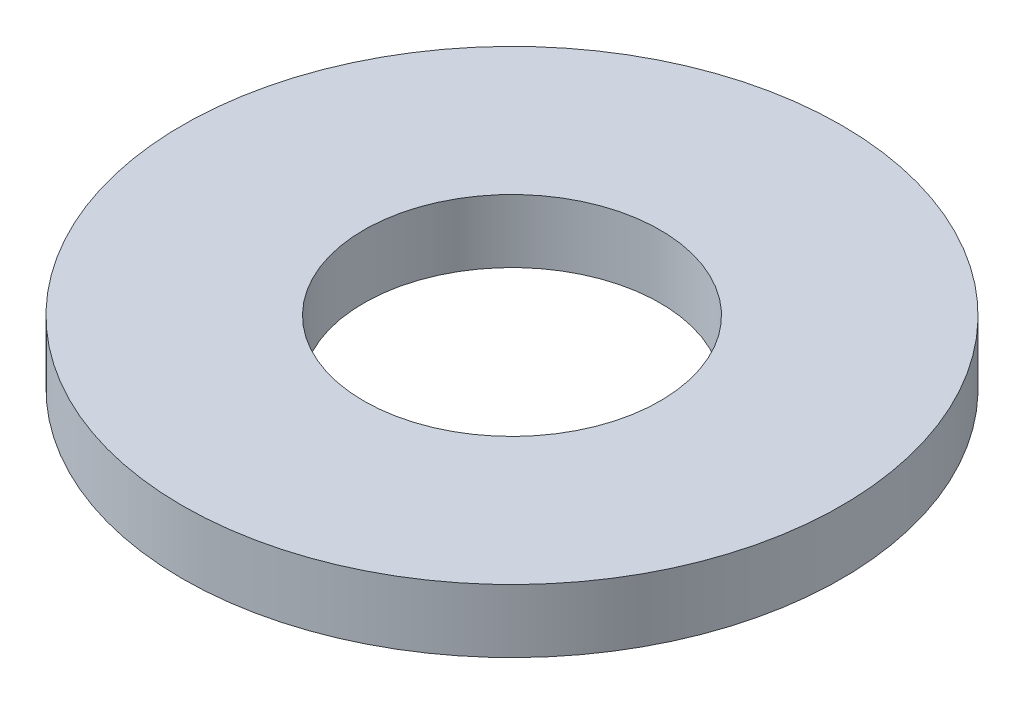
ISO-10303-21;
HEADER;
FILE_DESCRIPTION(('STEP AP214'),'2;1');
FILE_NAME('part.step','',(''),(''),'','','');
FILE_SCHEMA(('AUTOMOTIVE_DESIGN { 1 0 10303 214 1 1 1 1 }'));
ENDSEC;
DATA;
#1=APPLICATION_CONTEXT('core data for automotive mechanical design processes');
#2=APPLICATION_PROTOCOL_DEFINITION('international standard','automotive_design',2000,#1);
#3=PRODUCT_CONTEXT('',#1,'mechanical');
#4=PRODUCT('Part','Part','',(#3));
#5=PRODUCT_RELATED_PRODUCT_CATEGORY('part','',(#4));
#6=PRODUCT_DEFINITION_FORMATION('','',#4);
#7=PRODUCT_DEFINITION_CONTEXT('part definition',#1,'design');
#8=PRODUCT_DEFINITION('design','',#6,#7);
#9=PRODUCT_DEFINITION_SHAPE('','',#8);
#10=(LENGTH_UNIT() NAMED_UNIT(*) SI_UNIT(.MILLI.,.METRE.));
#11=(NAMED_UNIT(*) PLANE_ANGLE_UNIT() SI_UNIT($,.RADIAN.));
#12=(NAMED_UNIT(*) SI_UNIT($,.STERADIAN.) SOLID_ANGLE_UNIT());
#13=UNCERTAINTY_MEASURE_WITH_UNIT(LENGTH_MEASURE(1.E-05),#10,'distance_accuracy_value','');
#14=(GEOMETRIC_REPRESENTATION_CONTEXT(3) GLOBAL_UNCERTAINTY_ASSIGNED_CONTEXT((#13)) GLOBAL_UNIT_ASSIGNED_CONTEXT((#10,
#11,#12)) REPRESENTATION_CONTEXT('',''));
#15=CARTESIAN_POINT('',(0.,0.,0.));
#16=DIRECTION('',(0.,0.,1.));
#17=DIRECTION('',(1.,0.,0.));
#18=AXIS2_PLACEMENT_3D('',#15,#16,#17);
#19=CARTESIAN_POINT('',(0.,1.524,0.));
#20=DIRECTION('',(0.,-1.,0.));
#21=DIRECTION('',(0.,0.,-1.));
#22=AXIS2_PLACEMENT_3D('',#19,#20,#21);
#23=CYLINDRICAL_SURFACE('',#22,7.9375);
#24=CARTESIAN_POINT('',(0.,1.524,0.));
#25=DIRECTION('',(0.,1.,0.));
#26=DIRECTION('',(0.,0.,1.));
#27=AXIS2_PLACEMENT_3D('',#24,#25,#26);
#28=CIRCLE('',#27,7.9375);
#29=CARTESIAN_POINT('',(0.,1.524,7.9375));
#30=VERTEX_POINT('',#29);
#31=EDGE_CURVE('E10',#30,#30,#28,.T.);
#32=ORIENTED_EDGE('',*,*,#31,.F.);
#33=EDGE_LOOP('',(#32));
#34=FACE_BOUND('',#33,.T.);
#35=CARTESIAN_POINT('',(0.,0.,0.));
#36=DIRECTION('',(0.,1.,0.));
#37=DIRECTION('',(0.,0.,1.));
#38=AXIS2_PLACEMENT_3D('',#35,#36,#37);
#39=CIRCLE('',#38,7.9375);
#40=CARTESIAN_POINT('',(0.,0.,7.9375));
#41=VERTEX_POINT('',#40);
#42=EDGE_CURVE('E33',#41,#41,#39,.T.);
#43=ORIENTED_EDGE('',*,*,#42,.T.);
#44=EDGE_LOOP('',(#43));
#45=FACE_BOUND('',#44,.T.);
#46=ADVANCED_FACE('F30',(#34,#45),#23,.T.);
#47=CARTESIAN_POINT('',(0.,1.524,0.));
#48=DIRECTION('',(0.,1.,0.));
#49=DIRECTION('',(0.,0.,1.));
#50=AXIS2_PLACEMENT_3D('',#47,#48,#49);
#51=PLANE('',#50);
#52=CARTESIAN_POINT('',(0.,1.524,0.));
#53=DIRECTION('',(0.,1.,0.));
#54=DIRECTION('',(0.,0.,1.));
#55=AXIS2_PLACEMENT_3D('',#52,#53,#54);
#56=CIRCLE('',#55,3.5687);
#57=CARTESIAN_POINT('',(0.,1.524,3.5687));
#58=VERTEX_POINT('',#57);
#59=EDGE_CURVE('E42',#58,#58,#56,.T.);
#60=ORIENTED_EDGE('',*,*,#59,.F.);
#61=EDGE_LOOP('',(#60));
#62=FACE_BOUND('',#61,.T.);
#63=ORIENTED_EDGE('',*,*,#31,.T.);
#64=EDGE_LOOP('',(#63));
#65=FACE_BOUND('',#64,.T.);
#66=ADVANCED_FACE('F57',(#62,#65),#51,.T.);
#67=CARTESIAN_POINT('',(0.,0.,0.));
#68=DIRECTION('',(0.,1.,0.));
#69=DIRECTION('',(0.,0.,1.));
#70=AXIS2_PLACEMENT_3D('',#67,#68,#69);
#71=PLANE('',#70);
#72=CARTESIAN_POINT('',(0.,0.,0.));
#73=DIRECTION('',(0.,1.,0.));
#74=DIRECTION('',(0.,0.,1.));
#75=AXIS2_PLACEMENT_3D('',#72,#73,#74);
#76=CIRCLE('',#75,3.5687);
#77=CARTESIAN_POINT('',(0.,0.,3.5687));
#78=VERTEX_POINT('',#77);
#79=EDGE_CURVE('E40',#78,#78,#76,.T.);
#80=ORIENTED_EDGE('',*,*,#79,.T.);
#81=EDGE_LOOP('',(#80));
#82=FACE_BOUND('',#81,.T.);
#83=ORIENTED_EDGE('',*,*,#42,.F.);
#84=EDGE_LOOP('',(#83));
#85=FACE_BOUND('',#84,.T.);
#86=ADVANCED_FACE('F48',(#82,#85),#71,.F.);
#87=CARTESIAN_POINT('',(0.,0.,0.));
#88=DIRECTION('',(0.,1.,0.));
#89=DIRECTION('',(0.,0.,1.));
#90=AXIS2_PLACEMENT_3D('',#87,#88,#89);
#91=CYLINDRICAL_SURFACE('',#90,3.5687);
#92=ORIENTED_EDGE('',*,*,#79,.F.);
#93=EDGE_LOOP('',(#92));
#94=FACE_BOUND('',#93,.T.);
#95=ORIENTED_EDGE('',*,*,#59,.T.);
#96=EDGE_LOOP('',(#95));
#97=FACE_BOUND('',#96,.T.);
#98=ADVANCED_FACE('F51',(#94,#97),#91,.F.);
#99=CLOSED_SHELL('',(#46,#66,#86,#98));
#100=MANIFOLD_SOLID_BREP('B2',#99);
#101=ADVANCED_BREP_SHAPE_REPRESENTATION('',(#18,#100),#14);
#102=SHAPE_DEFINITION_REPRESENTATION(#9,#101);
ENDSEC;
END-ISO-10303-21;
